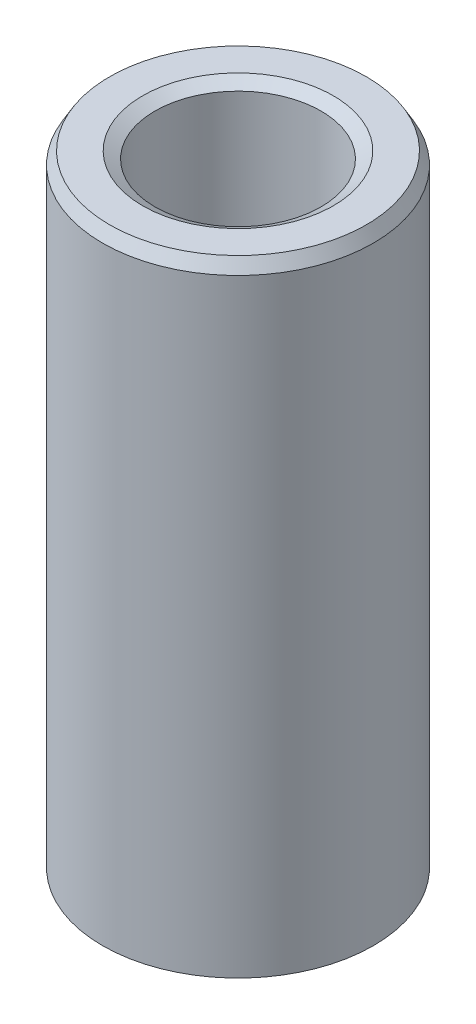
ISO-10303-21;
HEADER;
FILE_DESCRIPTION(('STEP AP214'),'2;1');
FILE_NAME('part.step','',(''),(''),'','','');
FILE_SCHEMA(('AUTOMOTIVE_DESIGN { 1 0 10303 214 1 1 1 1 }'));
ENDSEC;
DATA;
#1=APPLICATION_CONTEXT('core data for automotive mechanical design processes');
#2=APPLICATION_PROTOCOL_DEFINITION('international standard','automotive_design',2000,#1);
#3=PRODUCT_CONTEXT('',#1,'mechanical');
#4=PRODUCT('Part','Part','',(#3));
#5=PRODUCT_RELATED_PRODUCT_CATEGORY('part','',(#4));
#6=PRODUCT_DEFINITION_FORMATION('','',#4);
#7=PRODUCT_DEFINITION_CONTEXT('part definition',#1,'design');
#8=PRODUCT_DEFINITION('design','',#6,#7);
#9=PRODUCT_DEFINITION_SHAPE('','',#8);
#10=(LENGTH_UNIT() NAMED_UNIT(*) SI_UNIT(.MILLI.,.METRE.));
#11=(NAMED_UNIT(*) PLANE_ANGLE_UNIT() SI_UNIT($,.RADIAN.));
#12=(NAMED_UNIT(*) SI_UNIT($,.STERADIAN.) SOLID_ANGLE_UNIT());
#13=UNCERTAINTY_MEASURE_WITH_UNIT(LENGTH_MEASURE(1.E-05),#10,'distance_accuracy_value','');
#14=(GEOMETRIC_REPRESENTATION_CONTEXT(3) GLOBAL_UNCERTAINTY_ASSIGNED_CONTEXT((#13)) GLOBAL_UNIT_ASSIGNED_CONTEXT((#10,
#11,#12)) REPRESENTATION_CONTEXT('',''));
#15=CARTESIAN_POINT('',(0.,0.,0.));
#16=DIRECTION('',(0.,0.,1.));
#17=DIRECTION('',(1.,0.,0.));
#18=AXIS2_PLACEMENT_3D('',#15,#16,#17);
#19=CARTESIAN_POINT('',(0.,197.03125891405,0.));
#20=DIRECTION('',(0.,-1.,0.));
#21=DIRECTION('',(0.,0.,-1.));
#22=AXIS2_PLACEMENT_3D('',#19,#20,#21);
#23=CYLINDRICAL_SURFACE('',#22,42.5);
#24=CARTESIAN_POINT('',(0.,2.2255941821244,0.));
#25=DIRECTION('',(0.,1.,0.));
#26=DIRECTION('',(0.,0.,1.));
#27=AXIS2_PLACEMENT_3D('',#24,#25,#26);
#28=CIRCLE('',#27,42.5);
#29=CARTESIAN_POINT('',(0.,2.2255941821244,42.5));
#30=VERTEX_POINT('',#29);
#31=EDGE_CURVE('E10',#30,#30,#28,.T.);
#32=ORIENTED_EDGE('',*,*,#31,.T.);
#33=EDGE_LOOP('',(#32));
#34=FACE_BOUND('',#33,.T.);
#35=CARTESIAN_POINT('',(0.,193.176416713581,0.));
#36=DIRECTION('',(0.,1.,0.));
#37=DIRECTION('',(0.,0.,1.));
#38=AXIS2_PLACEMENT_3D('',#35,#36,#37);
#39=CIRCLE('',#38,42.5);
#40=CARTESIAN_POINT('',(0.,193.176416713581,42.5));
#41=VERTEX_POINT('',#40);
#42=EDGE_CURVE('E50',#41,#41,#39,.F.);
#43=ORIENTED_EDGE('',*,*,#42,.T.);
#44=EDGE_LOOP('',(#43));
#45=FACE_BOUND('',#44,.T.);
#46=ADVANCED_FACE('F39',(#34,#45),#23,.T.);
#47=CARTESIAN_POINT('',(0.,197.03125891405,0.));
#48=DIRECTION('',(0.,1.,0.));
#49=DIRECTION('',(0.,0.,1.));
#50=AXIS2_PLACEMENT_3D('',#47,#48,#49);
#51=PLANE('',#50);
#52=CARTESIAN_POINT('',(0.,197.03125891405,0.));
#53=DIRECTION('',(0.,1.,0.));
#54=DIRECTION('',(0.,0.,1.));
#55=AXIS2_PLACEMENT_3D('',#52,#53,#54);
#56=CIRCLE('',#55,29.9268429869157);
#57=CARTESIAN_POINT('',(0.,197.03125891405,29.9268429869157));
#58=VERTEX_POINT('',#57);
#59=EDGE_CURVE('E58',#58,#58,#56,.F.);
#60=ORIENTED_EDGE('',*,*,#59,.T.);
#61=EDGE_LOOP('',(#60));
#62=FACE_BOUND('',#61,.T.);
#63=CARTESIAN_POINT('',(0.,197.03125891405,0.));
#64=DIRECTION('',(0.,1.,0.));
#65=DIRECTION('',(0.,0.,1.));
#66=AXIS2_PLACEMENT_3D('',#63,#64,#65);
#67=CIRCLE('',#66,40.2744058178756);
#68=CARTESIAN_POINT('',(0.,197.03125891405,40.2744058178756));
#69=VERTEX_POINT('',#68);
#70=EDGE_CURVE('E61',#69,#69,#67,.T.);
#71=ORIENTED_EDGE('',*,*,#70,.T.);
#72=EDGE_LOOP('',(#71));
#73=FACE_BOUND('',#72,.T.);
#74=ADVANCED_FACE('F88',(#62,#73),#51,.T.);
#75=CARTESIAN_POINT('',(0.,0.,0.));
#76=DIRECTION('',(0.,1.,0.));
#77=DIRECTION('',(0.,0.,1.));
#78=AXIS2_PLACEMENT_3D('',#75,#76,#77);
#79=PLANE('',#78);
#80=CARTESIAN_POINT('',(0.,0.,0.));
#81=DIRECTION('',(0.,1.,0.));
#82=DIRECTION('',(0.,0.,1.));
#83=AXIS2_PLACEMENT_3D('',#80,#81,#82);
#84=CIRCLE('',#83,28.2975949685709);
#85=CARTESIAN_POINT('',(0.,0.,28.2975949685709));
#86=VERTEX_POINT('',#85);
#87=EDGE_CURVE('E51',#86,#86,#84,.T.);
#88=ORIENTED_EDGE('',*,*,#87,.T.);
#89=EDGE_LOOP('',(#88));
#90=FACE_BOUND('',#89,.T.);
#91=CARTESIAN_POINT('',(0.,0.,0.));
#92=DIRECTION('',(0.,1.,0.));
#93=DIRECTION('',(0.,0.,1.));
#94=AXIS2_PLACEMENT_3D('',#91,#92,#93);
#95=CIRCLE('',#94,38.6451577995308);
#96=CARTESIAN_POINT('',(0.,0.,38.6451577995308));
#97=VERTEX_POINT('',#96);
#98=EDGE_CURVE('E54',#97,#97,#95,.F.);
#99=ORIENTED_EDGE('',*,*,#98,.T.);
#100=EDGE_LOOP('',(#99));
#101=FACE_BOUND('',#100,.T.);
#102=ADVANCED_FACE('F83',(#90,#101),#79,.F.);
#103=CARTESIAN_POINT('',(0.,197.03125891405,0.));
#104=DIRECTION('',(0.,-1.,0.));
#105=DIRECTION('',(0.,0.,-1.));
#106=AXIS2_PLACEMENT_3D('',#103,#104,#105);
#107=CYLINDRICAL_SURFACE('',#106,26.0720007864465);
#108=CARTESIAN_POINT('',(0.,194.805664731926,0.));
#109=DIRECTION('',(0.,1.,0.));
#110=DIRECTION('',(0.,0.,1.));
#111=AXIS2_PLACEMENT_3D('',#108,#109,#110);
#112=CIRCLE('',#111,26.0720007864465);
#113=CARTESIAN_POINT('',(0.,194.805664731926,26.0720007864465));
#114=VERTEX_POINT('',#113);
#115=EDGE_CURVE('E67',#114,#114,#112,.T.);
#116=ORIENTED_EDGE('',*,*,#115,.T.);
#117=EDGE_LOOP('',(#116));
#118=FACE_BOUND('',#117,.T.);
#119=CARTESIAN_POINT('',(0.,3.85484220046917,0.));
#120=DIRECTION('',(0.,1.,0.));
#121=DIRECTION('',(0.,0.,1.));
#122=AXIS2_PLACEMENT_3D('',#119,#120,#121);
#123=CIRCLE('',#122,26.0720007864465);
#124=CARTESIAN_POINT('',(0.,3.85484220046917,26.0720007864465));
#125=VERTEX_POINT('',#124);
#126=EDGE_CURVE('E69',#125,#125,#123,.F.);
#127=ORIENTED_EDGE('',*,*,#126,.T.);
#128=EDGE_LOOP('',(#127));
#129=FACE_BOUND('',#128,.T.);
#130=ADVANCED_FACE('F71',(#118,#129),#107,.F.);
#131=CARTESIAN_POINT('',(0.,194.805664731926,0.));
#132=DIRECTION('',(0.,1.,0.));
#133=DIRECTION('',(0.,0.,1.));
#134=AXIS2_PLACEMENT_3D('',#131,#132,#133);
#135=CONICAL_SURFACE('',#134,26.0720007864465,1.0471975511966);
#136=ORIENTED_EDGE('',*,*,#59,.F.);
#137=EDGE_LOOP('',(#136));
#138=FACE_BOUND('',#137,.T.);
#139=ORIENTED_EDGE('',*,*,#115,.F.);
#140=EDGE_LOOP('',(#139));
#141=FACE_BOUND('',#140,.T.);
#142=ADVANCED_FACE('F77',(#138,#141),#135,.F.);
#143=CARTESIAN_POINT('',(0.,0.,0.));
#144=DIRECTION('',(0.,-1.,0.));
#145=DIRECTION('',(0.,0.,-1.));
#146=AXIS2_PLACEMENT_3D('',#143,#144,#145);
#147=CONICAL_SURFACE('',#146,28.2975949685709,0.523598775598292);
#148=ORIENTED_EDGE('',*,*,#126,.F.);
#149=EDGE_LOOP('',(#148));
#150=FACE_BOUND('',#149,.T.);
#151=ORIENTED_EDGE('',*,*,#87,.F.);
#152=EDGE_LOOP('',(#151));
#153=FACE_BOUND('',#152,.T.);
#154=ADVANCED_FACE('F73',(#150,#153),#147,.F.);
#155=CARTESIAN_POINT('',(0.,2.2255941821244,0.));
#156=DIRECTION('',(0.,1.,0.));
#157=DIRECTION('',(0.,0.,1.));
#158=AXIS2_PLACEMENT_3D('',#155,#156,#157);
#159=CONICAL_SURFACE('',#158,42.5,1.0471975511966);
#160=ORIENTED_EDGE('',*,*,#98,.F.);
#161=EDGE_LOOP('',(#160));
#162=FACE_BOUND('',#161,.T.);
#163=ORIENTED_EDGE('',*,*,#31,.F.);
#164=EDGE_LOOP('',(#163));
#165=FACE_BOUND('',#164,.T.);
#166=ADVANCED_FACE('F76',(#162,#165),#159,.T.);
#167=CARTESIAN_POINT('',(0.,197.03125891405,0.));
#168=DIRECTION('',(0.,-1.,0.));
#169=DIRECTION('',(0.,0.,-1.));
#170=AXIS2_PLACEMENT_3D('',#167,#168,#169);
#171=CONICAL_SURFACE('',#170,40.2744058178756,0.523598775598295);
#172=ORIENTED_EDGE('',*,*,#42,.F.);
#173=EDGE_LOOP('',(#172));
#174=FACE_BOUND('',#173,.T.);
#175=ORIENTED_EDGE('',*,*,#70,.F.);
#176=EDGE_LOOP('',(#175));
#177=FACE_BOUND('',#176,.T.);
#178=ADVANCED_FACE('F45',(#174,#177),#171,.T.);
#179=CLOSED_SHELL('',(#46,#74,#102,#130,#142,#154,#166,#178));
#180=MANIFOLD_SOLID_BREP('B2',#179);
#181=ADVANCED_BREP_SHAPE_REPRESENTATION('',(#18,#180),#14);
#182=SHAPE_DEFINITION_REPRESENTATION(#9,#181);
ENDSEC;
END-ISO-10303-21;
